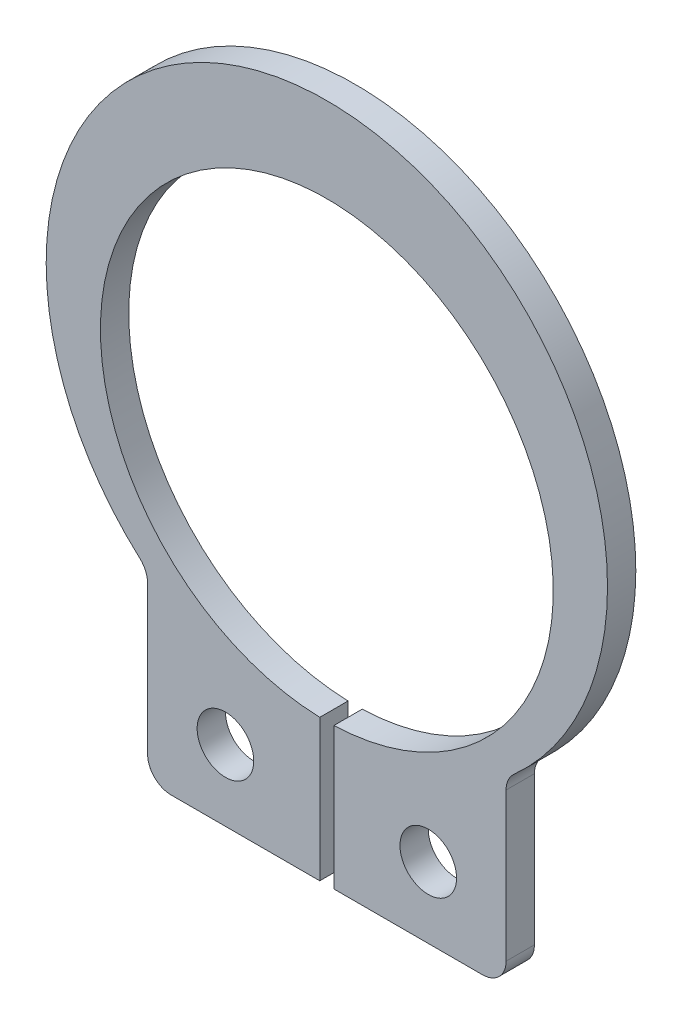
ISO-10303-21;
HEADER;
FILE_DESCRIPTION(('STEP AP214'),'2;1');
FILE_NAME('part.step','',(''),(''),'','','');
FILE_SCHEMA(('AUTOMOTIVE_DESIGN { 1 0 10303 214 1 1 1 1 }'));
ENDSEC;
DATA;
#1=APPLICATION_CONTEXT('core data for automotive mechanical design processes');
#2=APPLICATION_PROTOCOL_DEFINITION('international standard','automotive_design',2000,#1);
#3=PRODUCT_CONTEXT('',#1,'mechanical');
#4=PRODUCT('Part','Part','',(#3));
#5=PRODUCT_RELATED_PRODUCT_CATEGORY('part','',(#4));
#6=PRODUCT_DEFINITION_FORMATION('','',#4);
#7=PRODUCT_DEFINITION_CONTEXT('part definition',#1,'design');
#8=PRODUCT_DEFINITION('design','',#6,#7);
#9=PRODUCT_DEFINITION_SHAPE('','',#8);
#10=(LENGTH_UNIT() NAMED_UNIT(*) SI_UNIT(.MILLI.,.METRE.));
#11=(NAMED_UNIT(*) PLANE_ANGLE_UNIT() SI_UNIT($,.RADIAN.));
#12=(NAMED_UNIT(*) SI_UNIT($,.STERADIAN.) SOLID_ANGLE_UNIT());
#13=UNCERTAINTY_MEASURE_WITH_UNIT(LENGTH_MEASURE(1.E-05),#10,'distance_accuracy_value','');
#14=(GEOMETRIC_REPRESENTATION_CONTEXT(3) GLOBAL_UNCERTAINTY_ASSIGNED_CONTEXT((#13)) GLOBAL_UNIT_ASSIGNED_CONTEXT((#10,
#11,#12)) REPRESENTATION_CONTEXT('',''));
#15=CARTESIAN_POINT('',(0.,0.,0.));
#16=DIRECTION('',(0.,0.,1.));
#17=DIRECTION('',(1.,0.,0.));
#18=AXIS2_PLACEMENT_3D('',#15,#16,#17);
#19=CARTESIAN_POINT('',(4.3,-4.15754615162455,-0.6));
#20=DIRECTION('',(0.,0.,1.));
#21=DIRECTION('',(1.,0.,0.));
#22=AXIS2_PLACEMENT_3D('',#19,#20,#21);
#23=CYLINDRICAL_SURFACE('',#22,0.5);
#24=CARTESIAN_POINT('',(4.3,-4.15754615162455,0.));
#25=DIRECTION('',(0.,0.,-1.));
#26=DIRECTION('',(-1.,0.,0.));
#27=AXIS2_PLACEMENT_3D('',#24,#25,#26);
#28=CIRCLE('',#27,0.5);
#29=CARTESIAN_POINT('',(3.8,-4.15754615162455,0.));
#30=VERTEX_POINT('',#29);
#31=CARTESIAN_POINT('',(3.96666666666667,-3.78486815537458,0.));
#32=VERTEX_POINT('',#31);
#33=EDGE_CURVE('E155',#30,#32,#28,.T.);
#34=ORIENTED_EDGE('',*,*,#33,.F.);
#35=DIRECTION('',(0.,0.,1.));
#36=VECTOR('',#35,1.);
#37=CARTESIAN_POINT('',(3.8,-4.15754615162455,-0.6));
#38=LINE('',#37,#36);
#39=CARTESIAN_POINT('',(3.8,-4.15754615162455,-0.6));
#40=VERTEX_POINT('',#39);
#41=EDGE_CURVE('E11',#40,#30,#38,.T.);
#42=ORIENTED_EDGE('',*,*,#41,.F.);
#43=CARTESIAN_POINT('',(4.3,-4.15754615162455,-0.6));
#44=DIRECTION('',(0.,0.,-1.));
#45=DIRECTION('',(-1.,0.,0.));
#46=AXIS2_PLACEMENT_3D('',#43,#44,#45);
#47=CIRCLE('',#46,0.5);
#48=CARTESIAN_POINT('',(3.96666666666667,-3.78486815537458,-0.6));
#49=VERTEX_POINT('',#48);
#50=EDGE_CURVE('E188',#40,#49,#47,.T.);
#51=ORIENTED_EDGE('',*,*,#50,.T.);
#52=DIRECTION('',(0.,0.,1.));
#53=VECTOR('',#52,1.);
#54=CARTESIAN_POINT('',(3.96666666666667,-3.78486815537458,-0.6));
#55=LINE('',#54,#53);
#56=EDGE_CURVE('E37',#49,#32,#55,.T.);
#57=ORIENTED_EDGE('',*,*,#56,.T.);
#58=EDGE_LOOP('',(#34,#42,#51,#57));
#59=FACE_BOUND('',#58,.T.);
#60=ADVANCED_FACE('F34',(#59),#23,.F.);
#61=CARTESIAN_POINT('',(3.8,-7.3,-0.6));
#62=DIRECTION('',(1.,0.,0.));
#63=DIRECTION('',(0.,0.,-1.));
#64=AXIS2_PLACEMENT_3D('',#61,#62,#63);
#65=PLANE('',#64);
#66=DIRECTION('',(0.,1.,0.));
#67=VECTOR('',#66,1.);
#68=CARTESIAN_POINT('',(3.8,-7.3,0.));
#69=LINE('',#68,#67);
#70=CARTESIAN_POINT('',(3.8,-7.3,0.));
#71=VERTEX_POINT('',#70);
#72=EDGE_CURVE('E186',#71,#30,#69,.T.);
#73=ORIENTED_EDGE('',*,*,#72,.F.);
#74=DIRECTION('',(0.,0.,1.));
#75=VECTOR('',#74,1.);
#76=CARTESIAN_POINT('',(3.8,-7.3,-0.6));
#77=LINE('',#76,#75);
#78=CARTESIAN_POINT('',(3.8,-7.3,-0.6));
#79=VERTEX_POINT('',#78);
#80=EDGE_CURVE('E43',#79,#71,#77,.T.);
#81=ORIENTED_EDGE('',*,*,#80,.F.);
#82=DIRECTION('',(0.,1.,0.));
#83=VECTOR('',#82,1.);
#84=CARTESIAN_POINT('',(3.8,-7.3,-0.6));
#85=LINE('',#84,#83);
#86=EDGE_CURVE('E145',#79,#40,#85,.T.);
#87=ORIENTED_EDGE('',*,*,#86,.T.);
#88=ORIENTED_EDGE('',*,*,#41,.T.);
#89=EDGE_LOOP('',(#73,#81,#87,#88));
#90=FACE_BOUND('',#89,.T.);
#91=ADVANCED_FACE('F208',(#90),#65,.T.);
#92=CARTESIAN_POINT('',(3.3,-7.3,-0.6));
#93=DIRECTION('',(0.,0.,1.));
#94=DIRECTION('',(1.,0.,0.));
#95=AXIS2_PLACEMENT_3D('',#92,#93,#94);
#96=CYLINDRICAL_SURFACE('',#95,0.5);
#97=CARTESIAN_POINT('',(3.3,-7.3,0.));
#98=DIRECTION('',(0.,0.,1.));
#99=DIRECTION('',(1.,0.,0.));
#100=AXIS2_PLACEMENT_3D('',#97,#98,#99);
#101=CIRCLE('',#100,0.5);
#102=CARTESIAN_POINT('',(3.3,-7.8,0.));
#103=VERTEX_POINT('',#102);
#104=EDGE_CURVE('E132',#103,#71,#101,.T.);
#105=ORIENTED_EDGE('',*,*,#104,.F.);
#106=DIRECTION('',(0.,0.,1.));
#107=VECTOR('',#106,1.);
#108=CARTESIAN_POINT('',(3.3,-7.8,-0.6));
#109=LINE('',#108,#107);
#110=CARTESIAN_POINT('',(3.3,-7.8,-0.6));
#111=VERTEX_POINT('',#110);
#112=EDGE_CURVE('E127',#111,#103,#109,.T.);
#113=ORIENTED_EDGE('',*,*,#112,.F.);
#114=CARTESIAN_POINT('',(3.3,-7.3,-0.6));
#115=DIRECTION('',(0.,0.,1.));
#116=DIRECTION('',(1.,0.,0.));
#117=AXIS2_PLACEMENT_3D('',#114,#115,#116);
#118=CIRCLE('',#117,0.5);
#119=EDGE_CURVE('E130',#111,#79,#118,.T.);
#120=ORIENTED_EDGE('',*,*,#119,.T.);
#121=ORIENTED_EDGE('',*,*,#80,.T.);
#122=EDGE_LOOP('',(#105,#113,#120,#121));
#123=FACE_BOUND('',#122,.T.);
#124=ADVANCED_FACE('F129',(#123),#96,.T.);
#125=CARTESIAN_POINT('',(0.15,-7.8,-0.6));
#126=DIRECTION('',(0.,-1.,0.));
#127=DIRECTION('',(0.,0.,-1.));
#128=AXIS2_PLACEMENT_3D('',#125,#126,#127);
#129=PLANE('',#128);
#130=DIRECTION('',(1.,0.,0.));
#131=VECTOR('',#130,1.);
#132=CARTESIAN_POINT('',(0.15,-7.8,0.));
#133=LINE('',#132,#131);
#134=CARTESIAN_POINT('',(0.15,-7.8,0.));
#135=VERTEX_POINT('',#134);
#136=EDGE_CURVE('E183',#135,#103,#133,.T.);
#137=ORIENTED_EDGE('',*,*,#136,.F.);
#138=DIRECTION('',(0.,0.,1.));
#139=VECTOR('',#138,1.);
#140=CARTESIAN_POINT('',(0.15,-7.8,-0.6));
#141=LINE('',#140,#139);
#142=CARTESIAN_POINT('',(0.15,-7.8,-0.6));
#143=VERTEX_POINT('',#142);
#144=EDGE_CURVE('E137',#143,#135,#141,.T.);
#145=ORIENTED_EDGE('',*,*,#144,.F.);
#146=DIRECTION('',(1.,0.,0.));
#147=VECTOR('',#146,1.);
#148=CARTESIAN_POINT('',(0.15,-7.8,-0.6));
#149=LINE('',#148,#147);
#150=EDGE_CURVE('E143',#143,#111,#149,.T.);
#151=ORIENTED_EDGE('',*,*,#150,.T.);
#152=ORIENTED_EDGE('',*,*,#112,.T.);
#153=EDGE_LOOP('',(#137,#145,#151,#152));
#154=FACE_BOUND('',#153,.T.);
#155=ADVANCED_FACE('F147',(#154),#129,.T.);
#156=CARTESIAN_POINT('',(0.15,-4.79765567751584,-0.6));
#157=DIRECTION('',(-1.,0.,0.));
#158=DIRECTION('',(0.,-1.,0.));
#159=AXIS2_PLACEMENT_3D('',#156,#157,#158);
#160=PLANE('',#159);
#161=DIRECTION('',(0.,-1.,0.));
#162=VECTOR('',#161,1.);
#163=CARTESIAN_POINT('',(0.15,-4.79765567751584,0.));
#164=LINE('',#163,#162);
#165=CARTESIAN_POINT('',(0.150000000000003,-4.79765567751584,0.));
#166=VERTEX_POINT('',#165);
#167=EDGE_CURVE('E180',#166,#135,#164,.T.);
#168=ORIENTED_EDGE('',*,*,#167,.F.);
#169=DIRECTION('',(0.,0.,1.));
#170=VECTOR('',#169,1.);
#171=CARTESIAN_POINT('',(0.150000000000003,-4.79765567751584,-0.6));
#172=LINE('',#171,#170);
#173=CARTESIAN_POINT('',(0.150000000000003,-4.79765567751584,-0.6));
#174=VERTEX_POINT('',#173);
#175=EDGE_CURVE('E192',#174,#166,#172,.T.);
#176=ORIENTED_EDGE('',*,*,#175,.F.);
#177=DIRECTION('',(0.,-1.,0.));
#178=VECTOR('',#177,1.);
#179=CARTESIAN_POINT('',(0.15,-4.79765567751584,-0.6));
#180=LINE('',#179,#178);
#181=EDGE_CURVE('E148',#174,#143,#180,.T.);
#182=ORIENTED_EDGE('',*,*,#181,.T.);
#183=ORIENTED_EDGE('',*,*,#144,.T.);
#184=EDGE_LOOP('',(#168,#176,#182,#183));
#185=FACE_BOUND('',#184,.T.);
#186=ADVANCED_FACE('F221',(#185),#160,.T.);
#187=CARTESIAN_POINT('',(0.,0.,-0.6));
#188=DIRECTION('',(0.,0.,1.));
#189=DIRECTION('',(1.,0.,0.));
#190=AXIS2_PLACEMENT_3D('',#187,#188,#189);
#191=CYLINDRICAL_SURFACE('',#190,4.80000000000002);
#192=CARTESIAN_POINT('',(0.,0.,0.));
#193=DIRECTION('',(0.,0.,-1.));
#194=DIRECTION('',(-1.,0.,0.));
#195=AXIS2_PLACEMENT_3D('',#192,#193,#194);
#196=CIRCLE('',#195,4.80000000000002);
#197=CARTESIAN_POINT('',(-0.15,-4.79765567751584,0.));
#198=VERTEX_POINT('',#197);
#199=EDGE_CURVE('E177',#198,#166,#196,.T.);
#200=ORIENTED_EDGE('',*,*,#199,.F.);
#201=DIRECTION('',(0.,0.,1.));
#202=VECTOR('',#201,1.);
#203=CARTESIAN_POINT('',(-0.15,-4.79765567751584,-0.6));
#204=LINE('',#203,#202);
#205=CARTESIAN_POINT('',(-0.15,-4.79765567751584,-0.6));
#206=VERTEX_POINT('',#205);
#207=EDGE_CURVE('E194',#206,#198,#204,.T.);
#208=ORIENTED_EDGE('',*,*,#207,.F.);
#209=CARTESIAN_POINT('',(0.,0.,-0.6));
#210=DIRECTION('',(0.,0.,-1.));
#211=DIRECTION('',(-1.,0.,0.));
#212=AXIS2_PLACEMENT_3D('',#209,#210,#211);
#213=CIRCLE('',#212,4.80000000000002);
#214=EDGE_CURVE('E150',#206,#174,#213,.T.);
#215=ORIENTED_EDGE('',*,*,#214,.T.);
#216=ORIENTED_EDGE('',*,*,#175,.T.);
#217=EDGE_LOOP('',(#200,#208,#215,#216));
#218=FACE_BOUND('',#217,.T.);
#219=ADVANCED_FACE('F224',(#218),#191,.F.);
#220=CARTESIAN_POINT('',(-0.15,-7.8,-0.6));
#221=DIRECTION('',(1.,0.,0.));
#222=DIRECTION('',(0.,1.,0.));
#223=AXIS2_PLACEMENT_3D('',#220,#221,#222);
#224=PLANE('',#223);
#225=DIRECTION('',(0.,1.,0.));
#226=VECTOR('',#225,1.);
#227=CARTESIAN_POINT('',(-0.15,-7.8,0.));
#228=LINE('',#227,#226);
#229=CARTESIAN_POINT('',(-0.15,-7.8,0.));
#230=VERTEX_POINT('',#229);
#231=EDGE_CURVE('E174',#230,#198,#228,.T.);
#232=ORIENTED_EDGE('',*,*,#231,.F.);
#233=DIRECTION('',(0.,0.,1.));
#234=VECTOR('',#233,1.);
#235=CARTESIAN_POINT('',(-0.15,-7.8,-0.6));
#236=LINE('',#235,#234);
#237=CARTESIAN_POINT('',(-0.15,-7.8,-0.6));
#238=VERTEX_POINT('',#237);
#239=EDGE_CURVE('E196',#238,#230,#236,.T.);
#240=ORIENTED_EDGE('',*,*,#239,.F.);
#241=DIRECTION('',(0.,1.,0.));
#242=VECTOR('',#241,1.);
#243=CARTESIAN_POINT('',(-0.15,-7.8,-0.6));
#244=LINE('',#243,#242);
#245=EDGE_CURVE('E298',#238,#206,#244,.T.);
#246=ORIENTED_EDGE('',*,*,#245,.T.);
#247=ORIENTED_EDGE('',*,*,#207,.T.);
#248=EDGE_LOOP('',(#232,#240,#246,#247));
#249=FACE_BOUND('',#248,.T.);
#250=ADVANCED_FACE('F228',(#249),#224,.T.);
#251=CARTESIAN_POINT('',(-3.3,-7.8,-0.6));
#252=DIRECTION('',(0.,-1.,0.));
#253=DIRECTION('',(0.,0.,-1.));
#254=AXIS2_PLACEMENT_3D('',#251,#252,#253);
#255=PLANE('',#254);
#256=DIRECTION('',(1.,0.,0.));
#257=VECTOR('',#256,1.);
#258=CARTESIAN_POINT('',(-3.3,-7.8,0.));
#259=LINE('',#258,#257);
#260=CARTESIAN_POINT('',(-3.3,-7.8,0.));
#261=VERTEX_POINT('',#260);
#262=EDGE_CURVE('E171',#261,#230,#259,.T.);
#263=ORIENTED_EDGE('',*,*,#262,.F.);
#264=DIRECTION('',(0.,0.,1.));
#265=VECTOR('',#264,1.);
#266=CARTESIAN_POINT('',(-3.3,-7.8,-0.6));
#267=LINE('',#266,#265);
#268=CARTESIAN_POINT('',(-3.3,-7.8,-0.6));
#269=VERTEX_POINT('',#268);
#270=EDGE_CURVE('E198',#269,#261,#267,.T.);
#271=ORIENTED_EDGE('',*,*,#270,.F.);
#272=DIRECTION('',(1.,0.,0.));
#273=VECTOR('',#272,1.);
#274=CARTESIAN_POINT('',(-3.3,-7.8,-0.6));
#275=LINE('',#274,#273);
#276=EDGE_CURVE('E295',#269,#238,#275,.T.);
#277=ORIENTED_EDGE('',*,*,#276,.T.);
#278=ORIENTED_EDGE('',*,*,#239,.T.);
#279=EDGE_LOOP('',(#263,#271,#277,#278));
#280=FACE_BOUND('',#279,.T.);
#281=ADVANCED_FACE('F232',(#280),#255,.T.);
#282=CARTESIAN_POINT('',(-3.3,-7.3,-0.6));
#283=DIRECTION('',(0.,0.,1.));
#284=DIRECTION('',(1.,0.,0.));
#285=AXIS2_PLACEMENT_3D('',#282,#283,#284);
#286=CYLINDRICAL_SURFACE('',#285,0.5);
#287=CARTESIAN_POINT('',(-3.3,-7.3,0.));
#288=DIRECTION('',(0.,0.,1.));
#289=DIRECTION('',(1.,0.,0.));
#290=AXIS2_PLACEMENT_3D('',#287,#288,#289);
#291=CIRCLE('',#290,0.5);
#292=CARTESIAN_POINT('',(-3.8,-7.3,0.));
#293=VERTEX_POINT('',#292);
#294=EDGE_CURVE('E168',#293,#261,#291,.T.);
#295=ORIENTED_EDGE('',*,*,#294,.F.);
#296=DIRECTION('',(0.,0.,1.));
#297=VECTOR('',#296,1.);
#298=CARTESIAN_POINT('',(-3.8,-7.3,-0.6));
#299=LINE('',#298,#297);
#300=CARTESIAN_POINT('',(-3.8,-7.3,-0.6));
#301=VERTEX_POINT('',#300);
#302=EDGE_CURVE('E200',#301,#293,#299,.T.);
#303=ORIENTED_EDGE('',*,*,#302,.F.);
#304=CARTESIAN_POINT('',(-3.3,-7.3,-0.6));
#305=DIRECTION('',(0.,0.,1.));
#306=DIRECTION('',(1.,0.,0.));
#307=AXIS2_PLACEMENT_3D('',#304,#305,#306);
#308=CIRCLE('',#307,0.5);
#309=EDGE_CURVE('E292',#301,#269,#308,.T.);
#310=ORIENTED_EDGE('',*,*,#309,.T.);
#311=ORIENTED_EDGE('',*,*,#270,.T.);
#312=EDGE_LOOP('',(#295,#303,#310,#311));
#313=FACE_BOUND('',#312,.T.);
#314=ADVANCED_FACE('F236',(#313),#286,.T.);
#315=CARTESIAN_POINT('',(-3.8,-4.15754615162455,-0.6));
#316=DIRECTION('',(-1.,0.,0.));
#317=DIRECTION('',(0.,0.,1.));
#318=AXIS2_PLACEMENT_3D('',#315,#316,#317);
#319=PLANE('',#318);
#320=DIRECTION('',(0.,-1.,0.));
#321=VECTOR('',#320,1.);
#322=CARTESIAN_POINT('',(-3.8,-4.15754615162455,0.));
#323=LINE('',#322,#321);
#324=CARTESIAN_POINT('',(-3.8,-4.15754615162455,0.));
#325=VERTEX_POINT('',#324);
#326=EDGE_CURVE('E165',#325,#293,#323,.T.);
#327=ORIENTED_EDGE('',*,*,#326,.F.);
#328=DIRECTION('',(0.,0.,1.));
#329=VECTOR('',#328,1.);
#330=CARTESIAN_POINT('',(-3.8,-4.15754615162455,-0.6));
#331=LINE('',#330,#329);
#332=CARTESIAN_POINT('',(-3.8,-4.15754615162455,-0.6));
#333=VERTEX_POINT('',#332);
#334=EDGE_CURVE('E202',#333,#325,#331,.T.);
#335=ORIENTED_EDGE('',*,*,#334,.F.);
#336=DIRECTION('',(0.,-1.,0.));
#337=VECTOR('',#336,1.);
#338=CARTESIAN_POINT('',(-3.8,-4.15754615162455,-0.6));
#339=LINE('',#338,#337);
#340=EDGE_CURVE('E289',#333,#301,#339,.T.);
#341=ORIENTED_EDGE('',*,*,#340,.T.);
#342=ORIENTED_EDGE('',*,*,#302,.T.);
#343=EDGE_LOOP('',(#327,#335,#341,#342));
#344=FACE_BOUND('',#343,.T.);
#345=ADVANCED_FACE('F240',(#344),#319,.T.);
#346=CARTESIAN_POINT('',(-4.3,-4.15754615162455,-0.6));
#347=DIRECTION('',(0.,0.,1.));
#348=DIRECTION('',(1.,0.,0.));
#349=AXIS2_PLACEMENT_3D('',#346,#347,#348);
#350=CYLINDRICAL_SURFACE('',#349,0.5);
#351=CARTESIAN_POINT('',(-4.3,-4.15754615162455,0.));
#352=DIRECTION('',(0.,0.,-1.));
#353=DIRECTION('',(-1.,0.,0.));
#354=AXIS2_PLACEMENT_3D('',#351,#352,#353);
#355=CIRCLE('',#354,0.5);
#356=CARTESIAN_POINT('',(-3.96666666666667,-3.78486815537458,0.));
#357=VERTEX_POINT('',#356);
#358=EDGE_CURVE('E162',#357,#325,#355,.T.);
#359=ORIENTED_EDGE('',*,*,#358,.F.);
#360=DIRECTION('',(0.,0.,1.));
#361=VECTOR('',#360,1.);
#362=CARTESIAN_POINT('',(-3.96666666666667,-3.78486815537458,-0.6));
#363=LINE('',#362,#361);
#364=CARTESIAN_POINT('',(-3.96666666666667,-3.78486815537458,-0.6));
#365=VERTEX_POINT('',#364);
#366=EDGE_CURVE('E203',#365,#357,#363,.T.);
#367=ORIENTED_EDGE('',*,*,#366,.F.);
#368=CARTESIAN_POINT('',(-4.3,-4.15754615162455,-0.6));
#369=DIRECTION('',(0.,0.,-1.));
#370=DIRECTION('',(-1.,0.,0.));
#371=AXIS2_PLACEMENT_3D('',#368,#369,#370);
#372=CIRCLE('',#371,0.5);
#373=EDGE_CURVE('E286',#365,#333,#372,.T.);
#374=ORIENTED_EDGE('',*,*,#373,.T.);
#375=ORIENTED_EDGE('',*,*,#334,.T.);
#376=EDGE_LOOP('',(#359,#367,#374,#375));
#377=FACE_BOUND('',#376,.T.);
#378=ADVANCED_FACE('F244',(#377),#350,.F.);
#379=CARTESIAN_POINT('',(0.,0.65,-0.6));
#380=DIRECTION('',(0.,0.,1.));
#381=DIRECTION('',(1.,0.,0.));
#382=AXIS2_PLACEMENT_3D('',#379,#380,#381);
#383=CYLINDRICAL_SURFACE('',#382,5.95);
#384=CARTESIAN_POINT('',(0.,0.65,0.));
#385=DIRECTION('',(0.,0.,1.));
#386=DIRECTION('',(1.,0.,0.));
#387=AXIS2_PLACEMENT_3D('',#384,#385,#386);
#388=CIRCLE('',#387,5.95);
#389=EDGE_CURVE('E158',#32,#357,#388,.T.);
#390=ORIENTED_EDGE('',*,*,#389,.F.);
#391=ORIENTED_EDGE('',*,*,#56,.F.);
#392=CARTESIAN_POINT('',(0.,0.65,-0.6));
#393=DIRECTION('',(0.,0.,1.));
#394=DIRECTION('',(1.,0.,0.));
#395=AXIS2_PLACEMENT_3D('',#392,#393,#394);
#396=CIRCLE('',#395,5.95);
#397=EDGE_CURVE('E284',#49,#365,#396,.T.);
#398=ORIENTED_EDGE('',*,*,#397,.T.);
#399=ORIENTED_EDGE('',*,*,#366,.T.);
#400=EDGE_LOOP('',(#390,#391,#398,#399));
#401=FACE_BOUND('',#400,.T.);
#402=ADVANCED_FACE('F205',(#401),#383,.T.);
#403=CARTESIAN_POINT('',(4.3,-4.15754615162455,-0.6));
#404=DIRECTION('',(0.,0.,-1.));
#405=DIRECTION('',(-1.,0.,0.));
#406=AXIS2_PLACEMENT_3D('',#403,#404,#405);
#407=PLANE('',#406);
#408=CARTESIAN_POINT('',(2.15,-6.3,-0.6));
#409=DIRECTION('',(0.,0.,1.));
#410=DIRECTION('',(1.,0.,0.));
#411=AXIS2_PLACEMENT_3D('',#408,#409,#410);
#412=CIRCLE('',#411,0.6);
#413=CARTESIAN_POINT('',(2.75,-6.3,-0.6));
#414=VERTEX_POINT('',#413);
#415=EDGE_CURVE('E271',#414,#414,#412,.T.);
#416=ORIENTED_EDGE('',*,*,#415,.T.);
#417=EDGE_LOOP('',(#416));
#418=FACE_BOUND('',#417,.T.);
#419=CARTESIAN_POINT('',(-2.15,-6.3,-0.6));
#420=DIRECTION('',(0.,0.,1.));
#421=DIRECTION('',(1.,0.,0.));
#422=AXIS2_PLACEMENT_3D('',#419,#420,#421);
#423=CIRCLE('',#422,0.6);
#424=CARTESIAN_POINT('',(-1.55,-6.3,-0.6));
#425=VERTEX_POINT('',#424);
#426=EDGE_CURVE('E159',#425,#425,#423,.T.);
#427=ORIENTED_EDGE('',*,*,#426,.T.);
#428=EDGE_LOOP('',(#427));
#429=FACE_BOUND('',#428,.T.);
#430=ORIENTED_EDGE('',*,*,#50,.F.);
#431=ORIENTED_EDGE('',*,*,#86,.F.);
#432=ORIENTED_EDGE('',*,*,#119,.F.);
#433=ORIENTED_EDGE('',*,*,#150,.F.);
#434=ORIENTED_EDGE('',*,*,#181,.F.);
#435=ORIENTED_EDGE('',*,*,#214,.F.);
#436=ORIENTED_EDGE('',*,*,#245,.F.);
#437=ORIENTED_EDGE('',*,*,#276,.F.);
#438=ORIENTED_EDGE('',*,*,#309,.F.);
#439=ORIENTED_EDGE('',*,*,#340,.F.);
#440=ORIENTED_EDGE('',*,*,#373,.F.);
#441=ORIENTED_EDGE('',*,*,#397,.F.);
#442=EDGE_LOOP('',(#430,#431,#432,#433,#434,#435,#436,#437,#438,#439,#440,#441));
#443=FACE_BOUND('',#442,.T.);
#444=ADVANCED_FACE('F141',(#418,#429,#443),#407,.T.);
#445=CARTESIAN_POINT('',(4.3,-4.15754615162455,0.));
#446=DIRECTION('',(0.,0.,-1.));
#447=DIRECTION('',(-1.,0.,0.));
#448=AXIS2_PLACEMENT_3D('',#445,#446,#447);
#449=PLANE('',#448);
#450=CARTESIAN_POINT('',(2.15,-6.3,0.));
#451=DIRECTION('',(0.,0.,1.));
#452=DIRECTION('',(1.,0.,0.));
#453=AXIS2_PLACEMENT_3D('',#450,#451,#452);
#454=CIRCLE('',#453,0.6);
#455=CARTESIAN_POINT('',(2.75,-6.3,0.));
#456=VERTEX_POINT('',#455);
#457=EDGE_CURVE('E274',#456,#456,#454,.T.);
#458=ORIENTED_EDGE('',*,*,#457,.F.);
#459=EDGE_LOOP('',(#458));
#460=FACE_BOUND('',#459,.T.);
#461=CARTESIAN_POINT('',(-2.15,-6.3,0.));
#462=DIRECTION('',(0.,0.,1.));
#463=DIRECTION('',(1.,0.,0.));
#464=AXIS2_PLACEMENT_3D('',#461,#462,#463);
#465=CIRCLE('',#464,0.6);
#466=CARTESIAN_POINT('',(-1.55,-6.3,0.));
#467=VERTEX_POINT('',#466);
#468=EDGE_CURVE('E276',#467,#467,#465,.T.);
#469=ORIENTED_EDGE('',*,*,#468,.F.);
#470=EDGE_LOOP('',(#469));
#471=FACE_BOUND('',#470,.T.);
#472=ORIENTED_EDGE('',*,*,#33,.T.);
#473=ORIENTED_EDGE('',*,*,#389,.T.);
#474=ORIENTED_EDGE('',*,*,#358,.T.);
#475=ORIENTED_EDGE('',*,*,#326,.T.);
#476=ORIENTED_EDGE('',*,*,#294,.T.);
#477=ORIENTED_EDGE('',*,*,#262,.T.);
#478=ORIENTED_EDGE('',*,*,#231,.T.);
#479=ORIENTED_EDGE('',*,*,#199,.T.);
#480=ORIENTED_EDGE('',*,*,#167,.T.);
#481=ORIENTED_EDGE('',*,*,#136,.T.);
#482=ORIENTED_EDGE('',*,*,#104,.T.);
#483=ORIENTED_EDGE('',*,*,#72,.T.);
#484=EDGE_LOOP('',(#472,#473,#474,#475,#476,#477,#478,#479,#480,#481,#482,#483));
#485=FACE_BOUND('',#484,.T.);
#486=ADVANCED_FACE('F207',(#460,#471,#485),#449,.F.);
#487=CARTESIAN_POINT('',(-2.15,-6.3,-0.6));
#488=DIRECTION('',(0.,0.,1.));
#489=DIRECTION('',(1.,0.,0.));
#490=AXIS2_PLACEMENT_3D('',#487,#488,#489);
#491=CYLINDRICAL_SURFACE('',#490,0.6);
#492=ORIENTED_EDGE('',*,*,#426,.F.);
#493=EDGE_LOOP('',(#492));
#494=FACE_BOUND('',#493,.T.);
#495=ORIENTED_EDGE('',*,*,#468,.T.);
#496=EDGE_LOOP('',(#495));
#497=FACE_BOUND('',#496,.T.);
#498=ADVANCED_FACE('F256',(#494,#497),#491,.F.);
#499=CARTESIAN_POINT('',(2.15,-6.3,-0.6));
#500=DIRECTION('',(0.,0.,1.));
#501=DIRECTION('',(1.,0.,0.));
#502=AXIS2_PLACEMENT_3D('',#499,#500,#501);
#503=CYLINDRICAL_SURFACE('',#502,0.6);
#504=ORIENTED_EDGE('',*,*,#415,.F.);
#505=EDGE_LOOP('',(#504));
#506=FACE_BOUND('',#505,.T.);
#507=ORIENTED_EDGE('',*,*,#457,.T.);
#508=EDGE_LOOP('',(#507));
#509=FACE_BOUND('',#508,.T.);
#510=ADVANCED_FACE('F263',(#506,#509),#503,.F.);
#511=CLOSED_SHELL('',(#60,#91,#124,#155,#186,#219,#250,#281,#314,#345,#378,#402,#444,#486,#498,#510));
#512=MANIFOLD_SOLID_BREP('B2',#511);
#513=ADVANCED_BREP_SHAPE_REPRESENTATION('',(#18,#512),#14);
#514=SHAPE_DEFINITION_REPRESENTATION(#9,#513);
ENDSEC;
END-ISO-10303-21;
